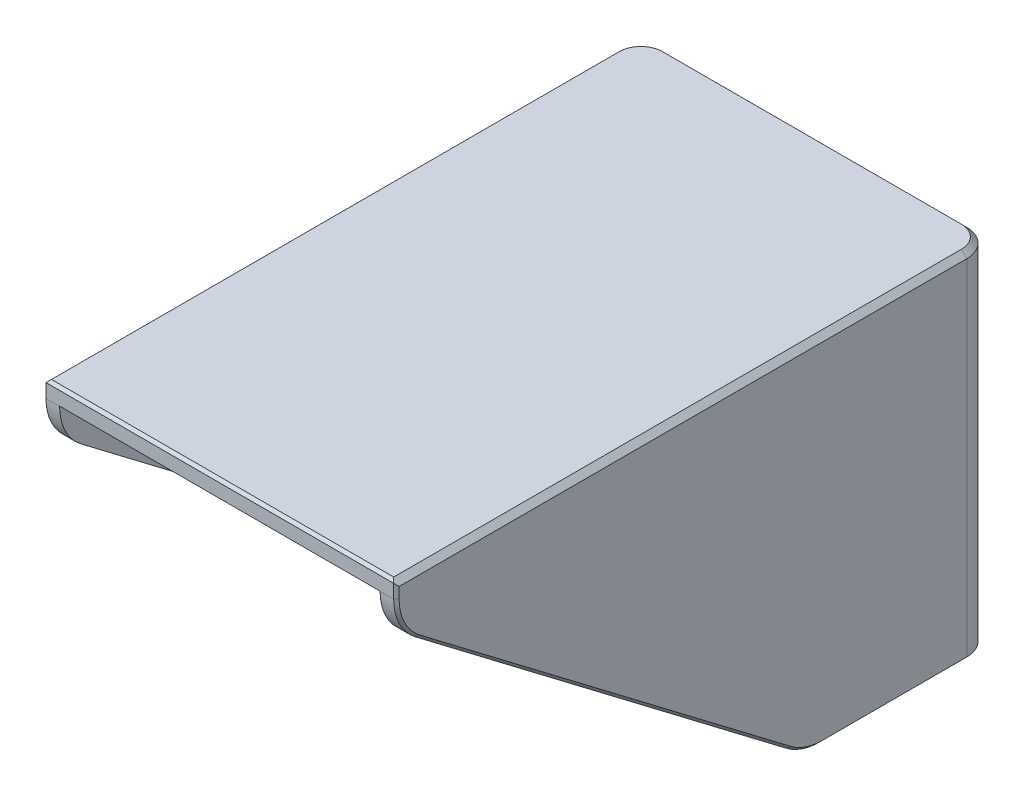
ISO-10303-21;
HEADER;
FILE_DESCRIPTION(('STEP AP214'),'2;1');
FILE_NAME('part.step','',(''),(''),'','','');
FILE_SCHEMA(('AUTOMOTIVE_DESIGN { 1 0 10303 214 1 1 1 1 }'));
ENDSEC;
DATA;
#1=APPLICATION_CONTEXT('core data for automotive mechanical design processes');
#2=APPLICATION_PROTOCOL_DEFINITION('international standard','automotive_design',2000,#1);
#3=PRODUCT_CONTEXT('',#1,'mechanical');
#4=PRODUCT('Part','Part','',(#3));
#5=PRODUCT_RELATED_PRODUCT_CATEGORY('part','',(#4));
#6=PRODUCT_DEFINITION_FORMATION('','',#4);
#7=PRODUCT_DEFINITION_CONTEXT('part definition',#1,'design');
#8=PRODUCT_DEFINITION('design','',#6,#7);
#9=PRODUCT_DEFINITION_SHAPE('','',#8);
#10=(LENGTH_UNIT() NAMED_UNIT(*) SI_UNIT(.MILLI.,.METRE.));
#11=(NAMED_UNIT(*) PLANE_ANGLE_UNIT() SI_UNIT($,.RADIAN.));
#12=(NAMED_UNIT(*) SI_UNIT($,.STERADIAN.) SOLID_ANGLE_UNIT());
#13=UNCERTAINTY_MEASURE_WITH_UNIT(LENGTH_MEASURE(1.E-05),#10,'distance_accuracy_value','');
#14=(GEOMETRIC_REPRESENTATION_CONTEXT(3) GLOBAL_UNCERTAINTY_ASSIGNED_CONTEXT((#13)) GLOBAL_UNIT_ASSIGNED_CONTEXT((#10,
#11,#12)) REPRESENTATION_CONTEXT('',''));
#15=CARTESIAN_POINT('',(0.,0.,0.));
#16=DIRECTION('',(0.,0.,1.));
#17=DIRECTION('',(1.,0.,0.));
#18=AXIS2_PLACEMENT_3D('',#15,#16,#17);
#19=CARTESIAN_POINT('',(0.,77.,0.));
#20=DIRECTION('',(0.,-1.,0.));
#21=DIRECTION('',(0.,0.,-1.));
#22=AXIS2_PLACEMENT_3D('',#19,#20,#21);
#23=PLANE('',#22);
#24=DIRECTION('',(-1.,0.,0.));
#25=VECTOR('',#24,1.);
#26=CARTESIAN_POINT('',(0.,77.,-59.5));
#27=LINE('',#26,#25);
#28=CARTESIAN_POINT('',(27.5,77.,-59.5));
#29=VERTEX_POINT('',#28);
#30=CARTESIAN_POINT('',(-27.5,77.,-59.5));
#31=VERTEX_POINT('',#30);
#32=EDGE_CURVE('E267',#29,#31,#27,.T.);
#33=ORIENTED_EDGE('',*,*,#32,.F.);
#34=CARTESIAN_POINT('',(27.5,77.,-57.5));
#35=DIRECTION('',(0.,-1.,0.));
#36=DIRECTION('',(0.,0.,-1.));
#37=AXIS2_PLACEMENT_3D('',#34,#35,#36);
#38=CIRCLE('',#37,2.);
#39=CARTESIAN_POINT('',(29.5,77.,-57.5));
#40=VERTEX_POINT('',#39);
#41=EDGE_CURVE('E265',#29,#40,#38,.T.);
#42=ORIENTED_EDGE('',*,*,#41,.T.);
#43=DIRECTION('',(0.,0.,-1.));
#44=VECTOR('',#43,1.);
#45=CARTESIAN_POINT('',(29.5,77.,0.));
#46=LINE('',#45,#44);
#47=CARTESIAN_POINT('',(29.5,77.,47.5));
#48=VERTEX_POINT('',#47);
#49=EDGE_CURVE('E240',#48,#40,#46,.T.);
#50=ORIENTED_EDGE('',*,*,#49,.F.);
#51=DIRECTION('',(-1.,0.,0.));
#52=VECTOR('',#51,1.);
#53=CARTESIAN_POINT('',(0.,77.,47.5));
#54=LINE('',#53,#52);
#55=CARTESIAN_POINT('',(-29.5,77.,47.5));
#56=VERTEX_POINT('',#55);
#57=EDGE_CURVE('E253',#48,#56,#54,.T.);
#58=ORIENTED_EDGE('',*,*,#57,.T.);
#59=DIRECTION('',(0.,0.,1.));
#60=VECTOR('',#59,1.);
#61=CARTESIAN_POINT('',(-29.5,77.,0.));
#62=LINE('',#61,#60);
#63=CARTESIAN_POINT('',(-29.5,77.,-57.5));
#64=VERTEX_POINT('',#63);
#65=EDGE_CURVE('E261',#64,#56,#62,.T.);
#66=ORIENTED_EDGE('',*,*,#65,.F.);
#67=CARTESIAN_POINT('',(-27.5,77.,-57.5));
#68=DIRECTION('',(0.,-1.,0.));
#69=DIRECTION('',(0.,0.,-1.));
#70=AXIS2_PLACEMENT_3D('',#67,#68,#69);
#71=CIRCLE('',#70,2.);
#72=EDGE_CURVE('E311',#64,#31,#71,.T.);
#73=ORIENTED_EDGE('',*,*,#72,.T.);
#74=EDGE_LOOP('',(#33,#42,#50,#58,#66,#73));
#75=FACE_BOUND('',#74,.T.);
#76=ADVANCED_FACE('F45',(#75),#23,.T.);
#77=CARTESIAN_POINT('',(-29.5,80.,62.5));
#78=DIRECTION('',(1.,0.,0.));
#79=DIRECTION('',(0.,0.,-1.));
#80=AXIS2_PLACEMENT_3D('',#77,#78,#79);
#81=PLANE('',#80);
#82=DIRECTION('',(0.,-1.,0.));
#83=VECTOR('',#82,1.);
#84=CARTESIAN_POINT('',(-29.5,80.,47.5));
#85=LINE('',#84,#83);
#86=CARTESIAN_POINT('',(-29.5,76.9602547744861,47.5));
#87=VERTEX_POINT('',#86);
#88=EDGE_CURVE('E249',#56,#87,#85,.T.);
#89=ORIENTED_EDGE('',*,*,#88,.T.);
#90=CARTESIAN_POINT('',(-29.5,76.9602547744861,37.5));
#91=DIRECTION('',(1.,0.,0.));
#92=DIRECTION('',(0.,0.,-1.));
#93=AXIS2_PLACEMENT_3D('',#90,#91,#92);
#94=CIRCLE('',#93,10.);
#95=CARTESIAN_POINT('',(-29.5,68.998632833255,43.5508326753356));
#96=VERTEX_POINT('',#95);
#97=EDGE_CURVE('E397',#87,#96,#94,.T.);
#98=ORIENTED_EDGE('',*,*,#97,.T.);
#99=DIRECTION('',(0.,-0.605083267533558,-0.796162194123103));
#100=VECTOR('',#99,1.);
#101=CARTESIAN_POINT('',(-29.5,82.1551724137931,60.8620689655172));
#102=LINE('',#101,#100);
#103=CARTESIAN_POINT('',(-29.5,17.038378058769,-24.817923606883));
#104=VERTEX_POINT('',#103);
#105=EDGE_CURVE('E260',#96,#104,#102,.T.);
#106=ORIENTED_EDGE('',*,*,#105,.T.);
#107=CARTESIAN_POINT('',(-29.5,25.,-30.8687562822185));
#108=DIRECTION('',(1.,0.,0.));
#109=DIRECTION('',(0.,0.,-1.));
#110=AXIS2_PLACEMENT_3D('',#107,#108,#109);
#111=CIRCLE('',#110,10.);
#112=CARTESIAN_POINT('',(-29.5,15.,-30.8687562822185));
#113=VERTEX_POINT('',#112);
#114=EDGE_CURVE('E394',#104,#113,#111,.T.);
#115=ORIENTED_EDGE('',*,*,#114,.T.);
#116=DIRECTION('',(0.,0.,-1.));
#117=VECTOR('',#116,1.);
#118=CARTESIAN_POINT('',(-29.5,15.,62.5));
#119=LINE('',#118,#117);
#120=CARTESIAN_POINT('',(-29.5,15.,-57.5));
#121=VERTEX_POINT('',#120);
#122=EDGE_CURVE('E284',#113,#121,#119,.T.);
#123=ORIENTED_EDGE('',*,*,#122,.T.);
#124=DIRECTION('',(0.,-1.,0.));
#125=VECTOR('',#124,1.);
#126=CARTESIAN_POINT('',(-29.5,77.,-57.5));
#127=LINE('',#126,#125);
#128=EDGE_CURVE('E316',#121,#64,#127,.F.);
#129=ORIENTED_EDGE('',*,*,#128,.T.);
#130=ORIENTED_EDGE('',*,*,#65,.T.);
#131=EDGE_LOOP('',(#89,#98,#106,#115,#123,#129,#130));
#132=FACE_BOUND('',#131,.T.);
#133=ADVANCED_FACE('F637',(#132),#81,.T.);
#134=CARTESIAN_POINT('',(-32.5,80.,-59.5));
#135=DIRECTION('',(0.,0.,1.));
#136=DIRECTION('',(1.,0.,0.));
#137=AXIS2_PLACEMENT_3D('',#134,#135,#136);
#138=PLANE('',#137);
#139=DIRECTION('',(1.,0.,0.));
#140=VECTOR('',#139,1.);
#141=CARTESIAN_POINT('',(-32.5,15.,-59.5));
#142=LINE('',#141,#140);
#143=CARTESIAN_POINT('',(-27.5,15.,-59.5));
#144=VERTEX_POINT('',#143);
#145=CARTESIAN_POINT('',(27.5,15.,-59.5));
#146=VERTEX_POINT('',#145);
#147=EDGE_CURVE('E275',#144,#146,#142,.T.);
#148=ORIENTED_EDGE('',*,*,#147,.T.);
#149=DIRECTION('',(0.,-1.,0.));
#150=VECTOR('',#149,1.);
#151=CARTESIAN_POINT('',(27.5,77.,-59.5));
#152=LINE('',#151,#150);
#153=EDGE_CURVE('E308',#146,#29,#152,.F.);
#154=ORIENTED_EDGE('',*,*,#153,.T.);
#155=ORIENTED_EDGE('',*,*,#32,.T.);
#156=DIRECTION('',(0.,-1.,0.));
#157=VECTOR('',#156,1.);
#158=CARTESIAN_POINT('',(-27.5,15.,-59.5));
#159=LINE('',#158,#157);
#160=EDGE_CURVE('E304',#31,#144,#159,.T.);
#161=ORIENTED_EDGE('',*,*,#160,.T.);
#162=EDGE_LOOP('',(#148,#154,#155,#161));
#163=FACE_BOUND('',#162,.T.);
#164=ADVANCED_FACE('F576',(#163),#138,.T.);
#165=CARTESIAN_POINT('',(29.5,80.,62.5));
#166=DIRECTION('',(-1.,0.,0.));
#167=DIRECTION('',(0.,0.,1.));
#168=AXIS2_PLACEMENT_3D('',#165,#166,#167);
#169=PLANE('',#168);
#170=DIRECTION('',(0.,0.605083267533558,0.796162194123103));
#171=VECTOR('',#170,1.);
#172=CARTESIAN_POINT('',(29.5,82.1551724137931,60.8620689655172));
#173=LINE('',#172,#171);
#174=CARTESIAN_POINT('',(29.5,17.038378058769,-24.817923606883));
#175=VERTEX_POINT('',#174);
#176=CARTESIAN_POINT('',(29.5,68.998632833255,43.5508326753356));
#177=VERTEX_POINT('',#176);
#178=EDGE_CURVE('E248',#175,#177,#173,.T.);
#179=ORIENTED_EDGE('',*,*,#178,.T.);
#180=CARTESIAN_POINT('',(29.5,76.9602547744861,37.5));
#181=DIRECTION('',(-1.,0.,0.));
#182=DIRECTION('',(0.,0.,1.));
#183=AXIS2_PLACEMENT_3D('',#180,#181,#182);
#184=CIRCLE('',#183,10.);
#185=CARTESIAN_POINT('',(29.5,76.9602547744861,47.5));
#186=VERTEX_POINT('',#185);
#187=EDGE_CURVE('E243',#177,#186,#184,.T.);
#188=ORIENTED_EDGE('',*,*,#187,.T.);
#189=DIRECTION('',(0.,1.,0.));
#190=VECTOR('',#189,1.);
#191=CARTESIAN_POINT('',(29.5,80.,47.5));
#192=LINE('',#191,#190);
#193=EDGE_CURVE('E234',#186,#48,#192,.T.);
#194=ORIENTED_EDGE('',*,*,#193,.T.);
#195=ORIENTED_EDGE('',*,*,#49,.T.);
#196=DIRECTION('',(0.,-1.,0.));
#197=VECTOR('',#196,1.);
#198=CARTESIAN_POINT('',(29.5,15.,-57.5));
#199=LINE('',#198,#197);
#200=CARTESIAN_POINT('',(29.5,15.,-57.5));
#201=VERTEX_POINT('',#200);
#202=EDGE_CURVE('E301',#40,#201,#199,.T.);
#203=ORIENTED_EDGE('',*,*,#202,.T.);
#204=DIRECTION('',(0.,0.,1.));
#205=VECTOR('',#204,1.);
#206=CARTESIAN_POINT('',(29.5,15.,62.5));
#207=LINE('',#206,#205);
#208=CARTESIAN_POINT('',(29.5,15.,-30.8687562822185));
#209=VERTEX_POINT('',#208);
#210=EDGE_CURVE('E268',#201,#209,#207,.T.);
#211=ORIENTED_EDGE('',*,*,#210,.T.);
#212=CARTESIAN_POINT('',(29.5,25.,-30.8687562822185));
#213=DIRECTION('',(-1.,0.,0.));
#214=DIRECTION('',(0.,0.,1.));
#215=AXIS2_PLACEMENT_3D('',#212,#213,#214);
#216=CIRCLE('',#215,10.);
#217=EDGE_CURVE('E389',#209,#175,#216,.T.);
#218=ORIENTED_EDGE('',*,*,#217,.T.);
#219=EDGE_LOOP('',(#179,#188,#194,#195,#203,#211,#218));
#220=FACE_BOUND('',#219,.T.);
#221=ADVANCED_FACE('F237',(#220),#169,.T.);
#222=CARTESIAN_POINT('',(-32.5,72.,47.5));
#223=DIRECTION('',(0.,-0.796162194123103,0.605083267533558));
#224=DIRECTION('',(0.,-0.605083267533558,-0.796162194123103));
#225=AXIS2_PLACEMENT_3D('',#222,#223,#224);
#226=PLANE('',#225);
#227=DIRECTION('',(1.,0.,0.));
#228=VECTOR('',#227,1.);
#229=CARTESIAN_POINT('',(-32.5,17.038378058769,-24.8179236068829));
#230=LINE('',#229,#228);
#231=CARTESIAN_POINT('',(32.,17.038378058769,-24.8179236068829));
#232=VERTEX_POINT('',#231);
#233=EDGE_CURVE('E383',#175,#232,#230,.T.);
#234=ORIENTED_EDGE('',*,*,#233,.T.);
#235=DIRECTION('',(0.,0.605083267533558,0.796162194123103));
#236=VECTOR('',#235,1.);
#237=CARTESIAN_POINT('',(32.,68.998632833255,43.5508326753356));
#238=LINE('',#237,#236);
#239=CARTESIAN_POINT('',(32.,68.998632833255,43.5508326753356));
#240=VERTEX_POINT('',#239);
#241=EDGE_CURVE('E56',#232,#240,#238,.T.);
#242=ORIENTED_EDGE('',*,*,#241,.T.);
#243=DIRECTION('',(1.,0.,0.));
#244=VECTOR('',#243,1.);
#245=CARTESIAN_POINT('',(-32.5,68.998632833255,43.5508326753356));
#246=LINE('',#245,#244);
#247=EDGE_CURVE('E386',#240,#177,#246,.F.);
#248=ORIENTED_EDGE('',*,*,#247,.T.);
#249=ORIENTED_EDGE('',*,*,#178,.F.);
#250=EDGE_LOOP('',(#234,#242,#248,#249));
#251=FACE_BOUND('',#250,.T.);
#252=ADVANCED_FACE('F974',(#251),#226,.T.);
#253=CARTESIAN_POINT('',(-32.5,15.,-27.5));
#254=DIRECTION('',(0.,-1.,0.));
#255=DIRECTION('',(0.,0.,-1.));
#256=AXIS2_PLACEMENT_3D('',#253,#254,#255);
#257=PLANE('',#256);
#258=DIRECTION('',(1.,0.,0.));
#259=VECTOR('',#258,1.);
#260=CARTESIAN_POINT('',(-32.5,15.,-30.8687562822185));
#261=LINE('',#260,#259);
#262=CARTESIAN_POINT('',(-32.,15.,-30.8687562822185));
#263=VERTEX_POINT('',#262);
#264=EDGE_CURVE('E407',#113,#263,#261,.F.);
#265=ORIENTED_EDGE('',*,*,#264,.T.);
#266=DIRECTION('',(0.,0.,-1.));
#267=VECTOR('',#266,1.);
#268=CARTESIAN_POINT('',(-32.,15.,-57.5));
#269=LINE('',#268,#267);
#270=CARTESIAN_POINT('',(-32.,15.,-57.5));
#271=VERTEX_POINT('',#270);
#272=EDGE_CURVE('E477',#263,#271,#269,.T.);
#273=ORIENTED_EDGE('',*,*,#272,.T.);
#274=CARTESIAN_POINT('',(-27.5,15.,-57.5));
#275=DIRECTION('',(0.,-1.,0.));
#276=DIRECTION('',(0.,0.,-1.));
#277=AXIS2_PLACEMENT_3D('',#274,#275,#276);
#278=CIRCLE('',#277,4.5);
#279=CARTESIAN_POINT('',(-27.5,15.,-62.));
#280=VERTEX_POINT('',#279);
#281=EDGE_CURVE('E474',#271,#280,#278,.T.);
#282=ORIENTED_EDGE('',*,*,#281,.T.);
#283=DIRECTION('',(1.,0.,0.));
#284=VECTOR('',#283,1.);
#285=CARTESIAN_POINT('',(27.5,15.,-62.));
#286=LINE('',#285,#284);
#287=CARTESIAN_POINT('',(27.5,15.,-62.));
#288=VERTEX_POINT('',#287);
#289=EDGE_CURVE('E471',#280,#288,#286,.T.);
#290=ORIENTED_EDGE('',*,*,#289,.T.);
#291=CARTESIAN_POINT('',(27.5,15.,-57.5));
#292=DIRECTION('',(0.,-1.,0.));
#293=DIRECTION('',(0.,0.,-1.));
#294=AXIS2_PLACEMENT_3D('',#291,#292,#293);
#295=CIRCLE('',#294,4.5);
#296=CARTESIAN_POINT('',(32.,15.,-57.5));
#297=VERTEX_POINT('',#296);
#298=EDGE_CURVE('E468',#288,#297,#295,.T.);
#299=ORIENTED_EDGE('',*,*,#298,.T.);
#300=DIRECTION('',(0.,0.,1.));
#301=VECTOR('',#300,1.);
#302=CARTESIAN_POINT('',(32.,15.,-30.8687562822185));
#303=LINE('',#302,#301);
#304=CARTESIAN_POINT('',(32.,15.,-30.8687562822185));
#305=VERTEX_POINT('',#304);
#306=EDGE_CURVE('E465',#297,#305,#303,.T.);
#307=ORIENTED_EDGE('',*,*,#306,.T.);
#308=DIRECTION('',(1.,0.,0.));
#309=VECTOR('',#308,1.);
#310=CARTESIAN_POINT('',(-32.5,15.,-30.8687562822185));
#311=LINE('',#310,#309);
#312=EDGE_CURVE('E411',#305,#209,#311,.F.);
#313=ORIENTED_EDGE('',*,*,#312,.T.);
#314=ORIENTED_EDGE('',*,*,#210,.F.);
#315=CARTESIAN_POINT('',(27.5,15.,-57.5));
#316=DIRECTION('',(0.,-1.,0.));
#317=DIRECTION('',(0.,0.,-1.));
#318=AXIS2_PLACEMENT_3D('',#315,#316,#317);
#319=CIRCLE('',#318,2.);
#320=EDGE_CURVE('E319',#201,#146,#319,.F.);
#321=ORIENTED_EDGE('',*,*,#320,.T.);
#322=ORIENTED_EDGE('',*,*,#147,.F.);
#323=CARTESIAN_POINT('',(-27.5,15.,-57.5));
#324=DIRECTION('',(0.,-1.,0.));
#325=DIRECTION('',(0.,0.,-1.));
#326=AXIS2_PLACEMENT_3D('',#323,#324,#325);
#327=CIRCLE('',#326,2.);
#328=EDGE_CURVE('E322',#144,#121,#327,.F.);
#329=ORIENTED_EDGE('',*,*,#328,.T.);
#330=ORIENTED_EDGE('',*,*,#122,.F.);
#331=EDGE_LOOP('',(#265,#273,#282,#290,#299,#307,#313,#314,#321,#322,#329,#330));
#332=FACE_BOUND('',#331,.T.);
#333=ADVANCED_FACE('F583',(#332),#257,.T.);
#334=DIRECTION('',(1.,0.,0.));
#335=VECTOR('',#334,1.);
#336=CARTESIAN_POINT('',(-32.5,68.998632833255,43.5508326753356));
#337=LINE('',#336,#335);
#338=CARTESIAN_POINT('',(-32.,68.998632833255,43.5508326753356));
#339=VERTEX_POINT('',#338);
#340=EDGE_CURVE('E403',#96,#339,#337,.F.);
#341=ORIENTED_EDGE('',*,*,#340,.T.);
#342=DIRECTION('',(0.,-0.605083267533558,-0.796162194123103));
#343=VECTOR('',#342,1.);
#344=CARTESIAN_POINT('',(-32.,17.038378058769,-24.8179236068829));
#345=LINE('',#344,#343);
#346=CARTESIAN_POINT('',(-32.,17.038378058769,-24.8179236068829));
#347=VERTEX_POINT('',#346);
#348=EDGE_CURVE('E459',#339,#347,#345,.T.);
#349=ORIENTED_EDGE('',*,*,#348,.T.);
#350=DIRECTION('',(1.,0.,0.));
#351=VECTOR('',#350,1.);
#352=CARTESIAN_POINT('',(-32.5,17.038378058769,-24.8179236068829));
#353=LINE('',#352,#351);
#354=EDGE_CURVE('E400',#347,#104,#353,.T.);
#355=ORIENTED_EDGE('',*,*,#354,.T.);
#356=ORIENTED_EDGE('',*,*,#105,.F.);
#357=EDGE_LOOP('',(#341,#349,#355,#356));
#358=FACE_BOUND('',#357,.T.);
#359=ADVANCED_FACE('F963',(#358),#226,.T.);
#360=CARTESIAN_POINT('',(-32.5,80.,47.5));
#361=DIRECTION('',(0.,0.,1.));
#362=DIRECTION('',(0.,-1.,0.));
#363=AXIS2_PLACEMENT_3D('',#360,#361,#362);
#364=PLANE('',#363);
#365=DIRECTION('',(-1.,0.,0.));
#366=VECTOR('',#365,1.);
#367=CARTESIAN_POINT('',(-31.5,79.5,47.5));
#368=LINE('',#367,#366);
#369=CARTESIAN_POINT('',(32.,79.5,47.5));
#370=VERTEX_POINT('',#369);
#371=CARTESIAN_POINT('',(-32.,79.5,47.5));
#372=VERTEX_POINT('',#371);
#373=EDGE_CURVE('E428',#370,#372,#368,.T.);
#374=ORIENTED_EDGE('',*,*,#373,.T.);
#375=DIRECTION('',(0.,-1.,0.));
#376=VECTOR('',#375,1.);
#377=CARTESIAN_POINT('',(-32.,76.9602547744861,47.5));
#378=LINE('',#377,#376);
#379=CARTESIAN_POINT('',(-32.,76.9602547744861,47.5));
#380=VERTEX_POINT('',#379);
#381=EDGE_CURVE('E431',#372,#380,#378,.T.);
#382=ORIENTED_EDGE('',*,*,#381,.T.);
#383=DIRECTION('',(1.,0.,0.));
#384=VECTOR('',#383,1.);
#385=CARTESIAN_POINT('',(-32.5,76.9602547744861,47.5));
#386=LINE('',#385,#384);
#387=EDGE_CURVE('E360',#380,#87,#386,.T.);
#388=ORIENTED_EDGE('',*,*,#387,.T.);
#389=ORIENTED_EDGE('',*,*,#88,.F.);
#390=ORIENTED_EDGE('',*,*,#57,.F.);
#391=ORIENTED_EDGE('',*,*,#193,.F.);
#392=DIRECTION('',(1.,0.,0.));
#393=VECTOR('',#392,1.);
#394=CARTESIAN_POINT('',(-32.5,76.9602547744861,47.5));
#395=LINE('',#394,#393);
#396=CARTESIAN_POINT('',(32.,76.9602547744861,47.5));
#397=VERTEX_POINT('',#396);
#398=EDGE_CURVE('E380',#186,#397,#395,.T.);
#399=ORIENTED_EDGE('',*,*,#398,.T.);
#400=DIRECTION('',(0.,1.,0.));
#401=VECTOR('',#400,1.);
#402=CARTESIAN_POINT('',(32.,79.,47.5));
#403=LINE('',#402,#401);
#404=EDGE_CURVE('E425',#397,#370,#403,.T.);
#405=ORIENTED_EDGE('',*,*,#404,.T.);
#406=EDGE_LOOP('',(#374,#382,#388,#389,#390,#391,#399,#405));
#407=FACE_BOUND('',#406,.T.);
#408=ADVANCED_FACE('F255',(#407),#364,.T.);
#409=CARTESIAN_POINT('',(32.5,80.,62.5));
#410=DIRECTION('',(-1.,0.,0.));
#411=DIRECTION('',(0.,0.,1.));
#412=AXIS2_PLACEMENT_3D('',#409,#410,#411);
#413=PLANE('',#412);
#414=CARTESIAN_POINT('',(32.5,25.,-30.8687562822185));
#415=DIRECTION('',(-1.,0.,0.));
#416=DIRECTION('',(0.,0.,1.));
#417=AXIS2_PLACEMENT_3D('',#414,#415,#416);
#418=CIRCLE('',#417,9.49999999999999);
#419=CARTESIAN_POINT('',(32.5,17.4364591558305,-25.1204652406497));
#420=VERTEX_POINT('',#419);
#421=CARTESIAN_POINT('',(32.5,15.5,-30.8687562822185));
#422=VERTEX_POINT('',#421);
#423=EDGE_CURVE('E498',#420,#422,#418,.F.);
#424=ORIENTED_EDGE('',*,*,#423,.T.);
#425=DIRECTION('',(0.,0.,-1.));
#426=VECTOR('',#425,1.);
#427=CARTESIAN_POINT('',(32.5,15.5,-57.5));
#428=LINE('',#427,#426);
#429=CARTESIAN_POINT('',(32.5,15.5,-57.5));
#430=VERTEX_POINT('',#429);
#431=EDGE_CURVE('E501',#422,#430,#428,.T.);
#432=ORIENTED_EDGE('',*,*,#431,.T.);
#433=DIRECTION('',(0.,-1.,0.));
#434=VECTOR('',#433,1.);
#435=CARTESIAN_POINT('',(32.5,80.,-57.5));
#436=LINE('',#435,#434);
#437=CARTESIAN_POINT('',(32.5,79.,-57.5));
#438=VERTEX_POINT('',#437);
#439=EDGE_CURVE('E298',#430,#438,#436,.F.);
#440=ORIENTED_EDGE('',*,*,#439,.T.);
#441=DIRECTION('',(0.,0.,1.));
#442=VECTOR('',#441,1.);
#443=CARTESIAN_POINT('',(32.5,79.,62.5));
#444=LINE('',#443,#442);
#445=CARTESIAN_POINT('',(32.5,79.,47.));
#446=VERTEX_POINT('',#445);
#447=EDGE_CURVE('E349',#438,#446,#444,.T.);
#448=ORIENTED_EDGE('',*,*,#447,.T.);
#449=DIRECTION('',(0.,-1.,0.));
#450=VECTOR('',#449,1.);
#451=CARTESIAN_POINT('',(32.5,76.9602547744861,47.));
#452=LINE('',#451,#450);
#453=CARTESIAN_POINT('',(32.5,76.9602547744861,47.));
#454=VERTEX_POINT('',#453);
#455=EDGE_CURVE('E495',#446,#454,#452,.T.);
#456=ORIENTED_EDGE('',*,*,#455,.T.);
#457=CARTESIAN_POINT('',(32.5,76.9602547744861,37.5));
#458=DIRECTION('',(-1.,0.,0.));
#459=DIRECTION('',(0.,0.,1.));
#460=AXIS2_PLACEMENT_3D('',#457,#458,#459);
#461=CIRCLE('',#460,9.49999999999999);
#462=CARTESIAN_POINT('',(32.5,69.3967139303166,43.2482910415688));
#463=VERTEX_POINT('',#462);
#464=EDGE_CURVE('E489',#454,#463,#461,.F.);
#465=ORIENTED_EDGE('',*,*,#464,.T.);
#466=DIRECTION('',(0.,-0.605083267533558,-0.796162194123103));
#467=VECTOR('',#466,1.);
#468=CARTESIAN_POINT('',(32.5,17.4364591558305,-25.1204652406497));
#469=LINE('',#468,#467);
#470=EDGE_CURVE('E492',#463,#420,#469,.T.);
#471=ORIENTED_EDGE('',*,*,#470,.T.);
#472=EDGE_LOOP('',(#424,#432,#440,#448,#456,#465,#471));
#473=FACE_BOUND('',#472,.T.);
#474=ADVANCED_FACE('F598',(#473),#413,.F.);
#475=CARTESIAN_POINT('',(-32.5,80.,-62.5));
#476=DIRECTION('',(0.,0.,1.));
#477=DIRECTION('',(1.,0.,0.));
#478=AXIS2_PLACEMENT_3D('',#475,#476,#477);
#479=PLANE('',#478);
#480=CARTESIAN_POINT('',(0.,55.,-62.5));
#481=DIRECTION('',(0.,0.,-1.));
#482=DIRECTION('',(-1.,0.,0.));
#483=AXIS2_PLACEMENT_3D('',#480,#481,#482);
#484=CIRCLE('',#483,15.24);
#485=CARTESIAN_POINT('',(-15.24,55.,-62.5));
#486=VERTEX_POINT('',#485);
#487=EDGE_CURVE('E554',#486,#486,#484,.T.);
#488=ORIENTED_EDGE('',*,*,#487,.F.);
#489=EDGE_LOOP('',(#488));
#490=FACE_BOUND('',#489,.T.);
#491=DIRECTION('',(0.,-1.,0.));
#492=VECTOR('',#491,1.);
#493=CARTESIAN_POINT('',(27.5,80.,-62.5));
#494=LINE('',#493,#492);
#495=CARTESIAN_POINT('',(27.5,79.,-62.5));
#496=VERTEX_POINT('',#495);
#497=CARTESIAN_POINT('',(27.5,15.5,-62.5));
#498=VERTEX_POINT('',#497);
#499=EDGE_CURVE('E291',#496,#498,#494,.T.);
#500=ORIENTED_EDGE('',*,*,#499,.T.);
#501=DIRECTION('',(-1.,0.,0.));
#502=VECTOR('',#501,1.);
#503=CARTESIAN_POINT('',(-27.5,15.5,-62.5));
#504=LINE('',#503,#502);
#505=CARTESIAN_POINT('',(-27.5,15.5,-62.5));
#506=VERTEX_POINT('',#505);
#507=EDGE_CURVE('E483',#498,#506,#504,.T.);
#508=ORIENTED_EDGE('',*,*,#507,.T.);
#509=DIRECTION('',(0.,-1.,0.));
#510=VECTOR('',#509,1.);
#511=CARTESIAN_POINT('',(-27.5,80.,-62.5));
#512=LINE('',#511,#510);
#513=CARTESIAN_POINT('',(-27.5,79.,-62.5));
#514=VERTEX_POINT('',#513);
#515=EDGE_CURVE('E295',#506,#514,#512,.F.);
#516=ORIENTED_EDGE('',*,*,#515,.T.);
#517=DIRECTION('',(1.,0.,0.));
#518=VECTOR('',#517,1.);
#519=CARTESIAN_POINT('',(-32.5,79.,-62.5));
#520=LINE('',#519,#518);
#521=EDGE_CURVE('E353',#514,#496,#520,.T.);
#522=ORIENTED_EDGE('',*,*,#521,.T.);
#523=EDGE_LOOP('',(#500,#508,#516,#522));
#524=FACE_BOUND('',#523,.T.);
#525=ADVANCED_FACE('F653',(#490,#524),#479,.F.);
#526=CARTESIAN_POINT('',(-32.5,80.,62.5));
#527=DIRECTION('',(1.,0.,0.));
#528=DIRECTION('',(0.,0.,-1.));
#529=AXIS2_PLACEMENT_3D('',#526,#527,#528);
#530=PLANE('',#529);
#531=CARTESIAN_POINT('',(-32.5,76.9602547744861,37.5));
#532=DIRECTION('',(1.,0.,0.));
#533=DIRECTION('',(0.,0.,-1.));
#534=AXIS2_PLACEMENT_3D('',#531,#532,#533);
#535=CIRCLE('',#534,9.49999999999999);
#536=CARTESIAN_POINT('',(-32.5,69.3967139303166,43.2482910415688));
#537=VERTEX_POINT('',#536);
#538=CARTESIAN_POINT('',(-32.5,76.9602547744861,47.));
#539=VERTEX_POINT('',#538);
#540=EDGE_CURVE('E450',#537,#539,#535,.F.);
#541=ORIENTED_EDGE('',*,*,#540,.T.);
#542=DIRECTION('',(0.,1.,0.));
#543=VECTOR('',#542,1.);
#544=CARTESIAN_POINT('',(-32.5,79.,47.));
#545=LINE('',#544,#543);
#546=CARTESIAN_POINT('',(-32.5,79.,47.));
#547=VERTEX_POINT('',#546);
#548=EDGE_CURVE('E453',#539,#547,#545,.T.);
#549=ORIENTED_EDGE('',*,*,#548,.T.);
#550=DIRECTION('',(0.,0.,-1.));
#551=VECTOR('',#550,1.);
#552=CARTESIAN_POINT('',(-32.5,79.,62.5));
#553=LINE('',#552,#551);
#554=CARTESIAN_POINT('',(-32.5,79.,-57.5));
#555=VERTEX_POINT('',#554);
#556=EDGE_CURVE('E342',#547,#555,#553,.T.);
#557=ORIENTED_EDGE('',*,*,#556,.T.);
#558=DIRECTION('',(0.,-1.,0.));
#559=VECTOR('',#558,1.);
#560=CARTESIAN_POINT('',(-32.5,80.,-57.5));
#561=LINE('',#560,#559);
#562=CARTESIAN_POINT('',(-32.5,15.5,-57.5));
#563=VERTEX_POINT('',#562);
#564=EDGE_CURVE('E287',#555,#563,#561,.T.);
#565=ORIENTED_EDGE('',*,*,#564,.T.);
#566=DIRECTION('',(0.,0.,1.));
#567=VECTOR('',#566,1.);
#568=CARTESIAN_POINT('',(-32.5,15.5,-30.8687562822185));
#569=LINE('',#568,#567);
#570=CARTESIAN_POINT('',(-32.5,15.5,-30.8687562822185));
#571=VERTEX_POINT('',#570);
#572=EDGE_CURVE('E441',#563,#571,#569,.T.);
#573=ORIENTED_EDGE('',*,*,#572,.T.);
#574=CARTESIAN_POINT('',(-32.5,25.,-30.8687562822185));
#575=DIRECTION('',(1.,0.,0.));
#576=DIRECTION('',(0.,0.,-1.));
#577=AXIS2_PLACEMENT_3D('',#574,#575,#576);
#578=CIRCLE('',#577,9.5);
#579=CARTESIAN_POINT('',(-32.5,17.4364591558305,-25.1204652406497));
#580=VERTEX_POINT('',#579);
#581=EDGE_CURVE('E444',#571,#580,#578,.F.);
#582=ORIENTED_EDGE('',*,*,#581,.T.);
#583=DIRECTION('',(0.,0.605083267533558,0.796162194123103));
#584=VECTOR('',#583,1.);
#585=CARTESIAN_POINT('',(-32.5,69.3967139303166,43.2482910415688));
#586=LINE('',#585,#584);
#587=EDGE_CURVE('E447',#580,#537,#586,.T.);
#588=ORIENTED_EDGE('',*,*,#587,.T.);
#589=EDGE_LOOP('',(#541,#549,#557,#565,#573,#582,#588));
#590=FACE_BOUND('',#589,.T.);
#591=ADVANCED_FACE('F650',(#590),#530,.F.);
#592=CARTESIAN_POINT('',(0.,80.,0.));
#593=DIRECTION('',(0.,-1.,0.));
#594=DIRECTION('',(0.,0.,-1.));
#595=AXIS2_PLACEMENT_3D('',#592,#593,#594);
#596=PLANE('',#595);
#597=DIRECTION('',(0.,0.,1.));
#598=VECTOR('',#597,1.);
#599=CARTESIAN_POINT('',(-31.5,80.,0.));
#600=LINE('',#599,#598);
#601=CARTESIAN_POINT('',(-31.5,80.,-57.5));
#602=VERTEX_POINT('',#601);
#603=CARTESIAN_POINT('',(-31.5,80.,47.));
#604=VERTEX_POINT('',#603);
#605=EDGE_CURVE('E338',#602,#604,#600,.T.);
#606=ORIENTED_EDGE('',*,*,#605,.T.);
#607=DIRECTION('',(1.,0.,0.));
#608=VECTOR('',#607,1.);
#609=CARTESIAN_POINT('',(31.5,80.,47.));
#610=LINE('',#609,#608);
#611=CARTESIAN_POINT('',(31.5,80.,47.));
#612=VERTEX_POINT('',#611);
#613=EDGE_CURVE('E414',#604,#612,#610,.T.);
#614=ORIENTED_EDGE('',*,*,#613,.T.);
#615=DIRECTION('',(0.,0.,-1.));
#616=VECTOR('',#615,1.);
#617=CARTESIAN_POINT('',(31.5,80.,0.));
#618=LINE('',#617,#616);
#619=CARTESIAN_POINT('',(31.5,80.,-57.5));
#620=VERTEX_POINT('',#619);
#621=EDGE_CURVE('E332',#612,#620,#618,.T.);
#622=ORIENTED_EDGE('',*,*,#621,.T.);
#623=CARTESIAN_POINT('',(27.5,80.,-57.5));
#624=DIRECTION('',(0.,-1.,0.));
#625=DIRECTION('',(0.,0.,-1.));
#626=AXIS2_PLACEMENT_3D('',#623,#624,#625);
#627=CIRCLE('',#626,4.);
#628=CARTESIAN_POINT('',(27.5,80.,-61.5));
#629=VERTEX_POINT('',#628);
#630=EDGE_CURVE('E326',#620,#629,#627,.F.);
#631=ORIENTED_EDGE('',*,*,#630,.T.);
#632=DIRECTION('',(-1.,0.,0.));
#633=VECTOR('',#632,1.);
#634=CARTESIAN_POINT('',(0.,80.,-61.5));
#635=LINE('',#634,#633);
#636=CARTESIAN_POINT('',(-27.5,80.,-61.5));
#637=VERTEX_POINT('',#636);
#638=EDGE_CURVE('E329',#629,#637,#635,.T.);
#639=ORIENTED_EDGE('',*,*,#638,.T.);
#640=CARTESIAN_POINT('',(-27.5,80.,-57.5));
#641=DIRECTION('',(0.,-1.,0.));
#642=DIRECTION('',(0.,0.,-1.));
#643=AXIS2_PLACEMENT_3D('',#640,#641,#642);
#644=CIRCLE('',#643,4.00000000000001);
#645=EDGE_CURVE('E335',#637,#602,#644,.F.);
#646=ORIENTED_EDGE('',*,*,#645,.T.);
#647=EDGE_LOOP('',(#606,#614,#622,#631,#639,#646));
#648=FACE_BOUND('',#647,.T.);
#649=ADVANCED_FACE('F616',(#648),#596,.F.);
#650=CARTESIAN_POINT('',(-27.5,80.,-57.5));
#651=DIRECTION('',(0.,-1.,0.));
#652=DIRECTION('',(0.,0.,-1.));
#653=AXIS2_PLACEMENT_3D('',#650,#651,#652);
#654=CYLINDRICAL_SURFACE('',#653,5.);
#655=ORIENTED_EDGE('',*,*,#515,.F.);
#656=CARTESIAN_POINT('',(-27.5,15.5,-57.5));
#657=DIRECTION('',(0.,-1.,0.));
#658=DIRECTION('',(0.,0.,-1.));
#659=AXIS2_PLACEMENT_3D('',#656,#657,#658);
#660=CIRCLE('',#659,5.);
#661=EDGE_CURVE('E480',#506,#563,#660,.F.);
#662=ORIENTED_EDGE('',*,*,#661,.T.);
#663=ORIENTED_EDGE('',*,*,#564,.F.);
#664=CARTESIAN_POINT('',(-27.5,79.,-57.5));
#665=DIRECTION('',(0.,-1.,0.));
#666=DIRECTION('',(0.,0.,-1.));
#667=AXIS2_PLACEMENT_3D('',#664,#665,#666);
#668=CIRCLE('',#667,5.);
#669=EDGE_CURVE('E345',#555,#514,#668,.T.);
#670=ORIENTED_EDGE('',*,*,#669,.T.);
#671=EDGE_LOOP('',(#655,#662,#663,#670));
#672=FACE_BOUND('',#671,.T.);
#673=ADVANCED_FACE('F649',(#672),#654,.T.);
#674=CARTESIAN_POINT('',(27.5,80.,-57.5));
#675=DIRECTION('',(0.,-1.,0.));
#676=DIRECTION('',(0.,0.,-1.));
#677=AXIS2_PLACEMENT_3D('',#674,#675,#676);
#678=CYLINDRICAL_SURFACE('',#677,5.);
#679=ORIENTED_EDGE('',*,*,#439,.F.);
#680=CARTESIAN_POINT('',(27.5,15.5,-57.5));
#681=DIRECTION('',(0.,-1.,0.));
#682=DIRECTION('',(0.,0.,-1.));
#683=AXIS2_PLACEMENT_3D('',#680,#681,#682);
#684=CIRCLE('',#683,5.);
#685=EDGE_CURVE('E486',#430,#498,#684,.F.);
#686=ORIENTED_EDGE('',*,*,#685,.T.);
#687=ORIENTED_EDGE('',*,*,#499,.F.);
#688=CARTESIAN_POINT('',(27.5,79.,-57.5));
#689=DIRECTION('',(0.,-1.,0.));
#690=DIRECTION('',(0.,0.,-1.));
#691=AXIS2_PLACEMENT_3D('',#688,#689,#690);
#692=CIRCLE('',#691,5.);
#693=EDGE_CURVE('E356',#496,#438,#692,.T.);
#694=ORIENTED_EDGE('',*,*,#693,.T.);
#695=EDGE_LOOP('',(#679,#686,#687,#694));
#696=FACE_BOUND('',#695,.T.);
#697=ADVANCED_FACE('F600',(#696),#678,.T.);
#698=CARTESIAN_POINT('',(27.5,80.,-57.5));
#699=DIRECTION('',(0.,1.,0.));
#700=DIRECTION('',(0.,0.,1.));
#701=AXIS2_PLACEMENT_3D('',#698,#699,#700);
#702=CYLINDRICAL_SURFACE('',#701,2.);
#703=ORIENTED_EDGE('',*,*,#41,.F.);
#704=ORIENTED_EDGE('',*,*,#153,.F.);
#705=ORIENTED_EDGE('',*,*,#320,.F.);
#706=ORIENTED_EDGE('',*,*,#202,.F.);
#707=EDGE_LOOP('',(#703,#704,#705,#706));
#708=FACE_BOUND('',#707,.T.);
#709=ADVANCED_FACE('F580',(#708),#702,.F.);
#710=CARTESIAN_POINT('',(-27.5,80.,-57.5));
#711=DIRECTION('',(0.,1.,0.));
#712=DIRECTION('',(0.,0.,1.));
#713=AXIS2_PLACEMENT_3D('',#710,#711,#712);
#714=CYLINDRICAL_SURFACE('',#713,2.);
#715=ORIENTED_EDGE('',*,*,#72,.F.);
#716=ORIENTED_EDGE('',*,*,#128,.F.);
#717=ORIENTED_EDGE('',*,*,#328,.F.);
#718=ORIENTED_EDGE('',*,*,#160,.F.);
#719=EDGE_LOOP('',(#715,#716,#717,#718));
#720=FACE_BOUND('',#719,.T.);
#721=ADVANCED_FACE('F667',(#720),#714,.F.);
#722=CARTESIAN_POINT('',(31.5,80.,0.));
#723=DIRECTION('',(-0.707106781186545,-0.70710678118655,0.));
#724=DIRECTION('',(0.,0.,-1.));
#725=AXIS2_PLACEMENT_3D('',#722,#723,#724);
#726=PLANE('',#725);
#727=ORIENTED_EDGE('',*,*,#621,.F.);
#728=DIRECTION('',(-0.577350269189628,0.577350269189624,-0.577350269189624));
#729=VECTOR('',#728,1.);
#730=CARTESIAN_POINT('',(15.8333333333333,95.6666666666666,31.3333333333334));
#731=LINE('',#730,#729);
#732=EDGE_CURVE('E421',#612,#370,#731,.F.);
#733=ORIENTED_EDGE('',*,*,#732,.T.);
#734=DIRECTION('',(-0.577350269189625,0.57735026918962,0.577350269189632));
#735=VECTOR('',#734,1.);
#736=CARTESIAN_POINT('',(47.5000000000002,64.,31.9999999999996));
#737=LINE('',#736,#735);
#738=EDGE_CURVE('E418',#370,#446,#737,.F.);
#739=ORIENTED_EDGE('',*,*,#738,.T.);
#740=ORIENTED_EDGE('',*,*,#447,.F.);
#741=DIRECTION('',(0.70710678118655,-0.707106781186545,0.));
#742=VECTOR('',#741,1.);
#743=CARTESIAN_POINT('',(31.5,80.,-57.5));
#744=LINE('',#743,#742);
#745=EDGE_CURVE('E374',#620,#438,#744,.T.);
#746=ORIENTED_EDGE('',*,*,#745,.F.);
#747=EDGE_LOOP('',(#727,#733,#739,#740,#746));
#748=FACE_BOUND('',#747,.T.);
#749=ADVANCED_FACE('F609',(#748),#726,.F.);
#750=CARTESIAN_POINT('',(27.5,80.,-57.5));
#751=DIRECTION('',(0.,-1.,0.));
#752=DIRECTION('',(0.,0.,-1.));
#753=AXIS2_PLACEMENT_3D('',#750,#751,#752);
#754=CONICAL_SURFACE('',#753,4.,0.785398163397453);
#755=ORIENTED_EDGE('',*,*,#745,.T.);
#756=ORIENTED_EDGE('',*,*,#693,.F.);
#757=DIRECTION('',(0.,-0.707106781186545,-0.70710678118655));
#758=VECTOR('',#757,1.);
#759=CARTESIAN_POINT('',(27.5,80.,-61.5));
#760=LINE('',#759,#758);
#761=EDGE_CURVE('E370',#629,#496,#760,.T.);
#762=ORIENTED_EDGE('',*,*,#761,.F.);
#763=ORIENTED_EDGE('',*,*,#630,.F.);
#764=EDGE_LOOP('',(#755,#756,#762,#763));
#765=FACE_BOUND('',#764,.T.);
#766=ADVANCED_FACE('F613',(#765),#754,.T.);
#767=CARTESIAN_POINT('',(0.,80.,-61.5));
#768=DIRECTION('',(0.,-0.70710678118655,0.707106781186545));
#769=DIRECTION('',(-1.,0.,0.));
#770=AXIS2_PLACEMENT_3D('',#767,#768,#769);
#771=PLANE('',#770);
#772=ORIENTED_EDGE('',*,*,#761,.T.);
#773=ORIENTED_EDGE('',*,*,#521,.F.);
#774=DIRECTION('',(0.,-0.707106781186545,-0.70710678118655));
#775=VECTOR('',#774,1.);
#776=CARTESIAN_POINT('',(-27.5,80.,-61.5));
#777=LINE('',#776,#775);
#778=EDGE_CURVE('E365',#637,#514,#777,.T.);
#779=ORIENTED_EDGE('',*,*,#778,.F.);
#780=ORIENTED_EDGE('',*,*,#638,.F.);
#781=EDGE_LOOP('',(#772,#773,#779,#780));
#782=FACE_BOUND('',#781,.T.);
#783=ADVANCED_FACE('F687',(#782),#771,.F.);
#784=CARTESIAN_POINT('',(-27.5,80.,-57.5));
#785=DIRECTION('',(0.,-1.,0.));
#786=DIRECTION('',(0.,0.,-1.));
#787=AXIS2_PLACEMENT_3D('',#784,#785,#786);
#788=CONICAL_SURFACE('',#787,4.00000000000001,0.785398163397451);
#789=ORIENTED_EDGE('',*,*,#778,.T.);
#790=ORIENTED_EDGE('',*,*,#669,.F.);
#791=DIRECTION('',(-0.70710678118655,-0.707106781186545,0.));
#792=VECTOR('',#791,1.);
#793=CARTESIAN_POINT('',(-31.5,80.,-57.5));
#794=LINE('',#793,#792);
#795=EDGE_CURVE('E361',#602,#555,#794,.T.);
#796=ORIENTED_EDGE('',*,*,#795,.F.);
#797=ORIENTED_EDGE('',*,*,#645,.F.);
#798=EDGE_LOOP('',(#789,#790,#796,#797));
#799=FACE_BOUND('',#798,.T.);
#800=ADVANCED_FACE('F680',(#799),#788,.T.);
#801=CARTESIAN_POINT('',(-31.5,80.,0.));
#802=DIRECTION('',(0.707106781186545,-0.70710678118655,0.));
#803=DIRECTION('',(0.,0.,1.));
#804=AXIS2_PLACEMENT_3D('',#801,#802,#803);
#805=PLANE('',#804);
#806=DIRECTION('',(-0.577350269189625,-0.57735026918962,-0.577350269189632));
#807=VECTOR('',#806,1.);
#808=CARTESIAN_POINT('',(-47.5000000000002,64.,31.9999999999997));
#809=LINE('',#808,#807);
#810=EDGE_CURVE('E435',#547,#372,#809,.F.);
#811=ORIENTED_EDGE('',*,*,#810,.T.);
#812=DIRECTION('',(-0.577350269189628,-0.577350269189624,0.577350269189624));
#813=VECTOR('',#812,1.);
#814=CARTESIAN_POINT('',(-15.8333333333333,95.6666666666666,31.3333333333334));
#815=LINE('',#814,#813);
#816=EDGE_CURVE('E438',#372,#604,#815,.F.);
#817=ORIENTED_EDGE('',*,*,#816,.T.);
#818=ORIENTED_EDGE('',*,*,#605,.F.);
#819=ORIENTED_EDGE('',*,*,#795,.T.);
#820=ORIENTED_EDGE('',*,*,#556,.F.);
#821=EDGE_LOOP('',(#811,#817,#818,#819,#820));
#822=FACE_BOUND('',#821,.T.);
#823=ADVANCED_FACE('F672',(#822),#805,.F.);
#824=CARTESIAN_POINT('',(0.,55.,-62.4));
#825=DIRECTION('',(0.,0.,-1.));
#826=DIRECTION('',(-1.,0.,0.));
#827=AXIS2_PLACEMENT_3D('',#824,#825,#826);
#828=CYLINDRICAL_SURFACE('',#827,15.24);
#829=CARTESIAN_POINT('',(0.,55.,-62.4));
#830=DIRECTION('',(0.,0.,-1.));
#831=DIRECTION('',(-1.,0.,0.));
#832=AXIS2_PLACEMENT_3D('',#829,#830,#831);
#833=CIRCLE('',#832,15.24);
#834=CARTESIAN_POINT('',(-15.24,55.,-62.4));
#835=VERTEX_POINT('',#834);
#836=EDGE_CURVE('E366',#835,#835,#833,.T.);
#837=ORIENTED_EDGE('',*,*,#836,.F.);
#838=EDGE_LOOP('',(#837));
#839=FACE_BOUND('',#838,.T.);
#840=ORIENTED_EDGE('',*,*,#487,.T.);
#841=EDGE_LOOP('',(#840));
#842=FACE_BOUND('',#841,.T.);
#843=ADVANCED_FACE('F679',(#839,#842),#828,.F.);
#844=CARTESIAN_POINT('',(0.,55.,-62.4));
#845=DIRECTION('',(0.,0.,-1.));
#846=DIRECTION('',(-1.,0.,0.));
#847=AXIS2_PLACEMENT_3D('',#844,#845,#846);
#848=PLANE('',#847);
#849=ORIENTED_EDGE('',*,*,#836,.T.);
#850=EDGE_LOOP('',(#849));
#851=FACE_BOUND('',#850,.T.);
#852=ADVANCED_FACE('F708',(#851),#848,.T.);
#853=CARTESIAN_POINT('',(-32.5,76.9602547744861,37.5));
#854=DIRECTION('',(1.,0.,0.));
#855=DIRECTION('',(0.,0.,-1.));
#856=AXIS2_PLACEMENT_3D('',#853,#854,#855);
#857=CYLINDRICAL_SURFACE('',#856,10.);
#858=ORIENTED_EDGE('',*,*,#247,.F.);
#859=CARTESIAN_POINT('',(32.,76.9602547744861,37.5));
#860=DIRECTION('',(-1.,0.,0.));
#861=DIRECTION('',(0.,0.,1.));
#862=AXIS2_PLACEMENT_3D('',#859,#860,#861);
#863=CIRCLE('',#862,10.);
#864=EDGE_CURVE('E12',#240,#397,#863,.T.);
#865=ORIENTED_EDGE('',*,*,#864,.T.);
#866=ORIENTED_EDGE('',*,*,#398,.F.);
#867=ORIENTED_EDGE('',*,*,#187,.F.);
#868=EDGE_LOOP('',(#858,#865,#866,#867));
#869=FACE_BOUND('',#868,.T.);
#870=ADVANCED_FACE('F704',(#869),#857,.T.);
#871=CARTESIAN_POINT('',(-32.5,76.9602547744861,37.5));
#872=DIRECTION('',(1.,0.,0.));
#873=DIRECTION('',(0.,0.,-1.));
#874=AXIS2_PLACEMENT_3D('',#871,#872,#873);
#875=CYLINDRICAL_SURFACE('',#874,10.);
#876=ORIENTED_EDGE('',*,*,#387,.F.);
#877=CARTESIAN_POINT('',(-32.,76.9602547744861,37.5));
#878=DIRECTION('',(1.,0.,0.));
#879=DIRECTION('',(0.,0.,-1.));
#880=AXIS2_PLACEMENT_3D('',#877,#878,#879);
#881=CIRCLE('',#880,10.);
#882=EDGE_CURVE('E456',#380,#339,#881,.T.);
#883=ORIENTED_EDGE('',*,*,#882,.T.);
#884=ORIENTED_EDGE('',*,*,#340,.F.);
#885=ORIENTED_EDGE('',*,*,#97,.F.);
#886=EDGE_LOOP('',(#876,#883,#884,#885));
#887=FACE_BOUND('',#886,.T.);
#888=ADVANCED_FACE('F707',(#887),#875,.T.);
#889=CARTESIAN_POINT('',(-32.5,25.,-30.8687562822185));
#890=DIRECTION('',(1.,0.,0.));
#891=DIRECTION('',(0.,0.,-1.));
#892=AXIS2_PLACEMENT_3D('',#889,#890,#891);
#893=CYLINDRICAL_SURFACE('',#892,10.);
#894=ORIENTED_EDGE('',*,*,#312,.F.);
#895=CARTESIAN_POINT('',(32.,25.,-30.8687562822185));
#896=DIRECTION('',(-1.,0.,0.));
#897=DIRECTION('',(0.,0.,1.));
#898=AXIS2_PLACEMENT_3D('',#895,#896,#897);
#899=CIRCLE('',#898,10.);
#900=EDGE_CURVE('E71',#305,#232,#899,.T.);
#901=ORIENTED_EDGE('',*,*,#900,.T.);
#902=ORIENTED_EDGE('',*,*,#233,.F.);
#903=ORIENTED_EDGE('',*,*,#217,.F.);
#904=EDGE_LOOP('',(#894,#901,#902,#903));
#905=FACE_BOUND('',#904,.T.);
#906=ADVANCED_FACE('F585',(#905),#893,.T.);
#907=CARTESIAN_POINT('',(-32.5,25.,-30.8687562822185));
#908=DIRECTION('',(1.,0.,0.));
#909=DIRECTION('',(0.,0.,-1.));
#910=AXIS2_PLACEMENT_3D('',#907,#908,#909);
#911=CYLINDRICAL_SURFACE('',#910,10.);
#912=ORIENTED_EDGE('',*,*,#354,.F.);
#913=CARTESIAN_POINT('',(-32.,25.,-30.8687562822185));
#914=DIRECTION('',(1.,0.,0.));
#915=DIRECTION('',(0.,0.,-1.));
#916=AXIS2_PLACEMENT_3D('',#913,#914,#915);
#917=CIRCLE('',#916,10.);
#918=EDGE_CURVE('E462',#347,#263,#917,.T.);
#919=ORIENTED_EDGE('',*,*,#918,.T.);
#920=ORIENTED_EDGE('',*,*,#264,.F.);
#921=ORIENTED_EDGE('',*,*,#114,.F.);
#922=EDGE_LOOP('',(#912,#919,#920,#921));
#923=FACE_BOUND('',#922,.T.);
#924=ADVANCED_FACE('F715',(#923),#911,.T.);
#925=CARTESIAN_POINT('',(0.,80.,47.));
#926=DIRECTION('',(0.,0.707106781186548,0.707106781186548));
#927=DIRECTION('',(-1.,0.,0.));
#928=AXIS2_PLACEMENT_3D('',#925,#926,#927);
#929=PLANE('',#928);
#930=ORIENTED_EDGE('',*,*,#816,.F.);
#931=ORIENTED_EDGE('',*,*,#373,.F.);
#932=ORIENTED_EDGE('',*,*,#732,.F.);
#933=ORIENTED_EDGE('',*,*,#613,.F.);
#934=EDGE_LOOP('',(#930,#931,#932,#933));
#935=FACE_BOUND('',#934,.T.);
#936=ADVANCED_FACE('F622',(#935),#929,.T.);
#937=CARTESIAN_POINT('',(32.5,80.,47.));
#938=DIRECTION('',(0.707106781186552,0.,0.707106781186542));
#939=DIRECTION('',(0.,1.,0.));
#940=AXIS2_PLACEMENT_3D('',#937,#938,#939);
#941=PLANE('',#940);
#942=ORIENTED_EDGE('',*,*,#738,.F.);
#943=ORIENTED_EDGE('',*,*,#404,.F.);
#944=DIRECTION('',(-0.707106781186542,0.,0.707106781186552));
#945=VECTOR('',#944,1.);
#946=CARTESIAN_POINT('',(32.5,76.9602547744861,47.));
#947=LINE('',#946,#945);
#948=EDGE_CURVE('E50',#454,#397,#947,.T.);
#949=ORIENTED_EDGE('',*,*,#948,.F.);
#950=ORIENTED_EDGE('',*,*,#455,.F.);
#951=EDGE_LOOP('',(#942,#943,#949,#950));
#952=FACE_BOUND('',#951,.T.);
#953=ADVANCED_FACE('F48',(#952),#941,.T.);
#954=CARTESIAN_POINT('',(32.5,76.9602547744861,37.5));
#955=DIRECTION('',(-1.,0.,0.));
#956=DIRECTION('',(0.,0.,1.));
#957=AXIS2_PLACEMENT_3D('',#954,#955,#956);
#958=CONICAL_SURFACE('',#957,9.49999999999999,0.785398163397457);
#959=ORIENTED_EDGE('',*,*,#948,.T.);
#960=ORIENTED_EDGE('',*,*,#864,.F.);
#961=DIRECTION('',(-0.707106781186539,-0.562971686388814,0.427858481655497));
#962=VECTOR('',#961,1.);
#963=CARTESIAN_POINT('',(32.5,69.3967139303166,43.2482910415688));
#964=LINE('',#963,#962);
#965=EDGE_CURVE('E546',#463,#240,#964,.T.);
#966=ORIENTED_EDGE('',*,*,#965,.F.);
#967=ORIENTED_EDGE('',*,*,#464,.F.);
#968=EDGE_LOOP('',(#959,#960,#966,#967));
#969=FACE_BOUND('',#968,.T.);
#970=ADVANCED_FACE('F626',(#969),#958,.T.);
#971=CARTESIAN_POINT('',(32.5,82.5532535108547,60.5595273317505));
#972=DIRECTION('',(0.70710678118656,-0.562971686388797,0.427858481655485));
#973=DIRECTION('',(0.,0.605083267533558,0.796162194123103));
#974=AXIS2_PLACEMENT_3D('',#971,#972,#973);
#975=PLANE('',#974);
#976=ORIENTED_EDGE('',*,*,#965,.T.);
#977=ORIENTED_EDGE('',*,*,#241,.F.);
#978=DIRECTION('',(-0.707106781186536,-0.562971686388816,0.427858481655499));
#979=VECTOR('',#978,1.);
#980=CARTESIAN_POINT('',(32.5,17.4364591558305,-25.1204652406497));
#981=LINE('',#980,#979);
#982=EDGE_CURVE('E543',#420,#232,#981,.T.);
#983=ORIENTED_EDGE('',*,*,#982,.F.);
#984=ORIENTED_EDGE('',*,*,#470,.F.);
#985=EDGE_LOOP('',(#976,#977,#983,#984));
#986=FACE_BOUND('',#985,.T.);
#987=ADVANCED_FACE('F627',(#986),#975,.T.);
#988=CARTESIAN_POINT('',(32.5,25.,-30.8687562822185));
#989=DIRECTION('',(-1.,0.,0.));
#990=DIRECTION('',(0.,0.,1.));
#991=AXIS2_PLACEMENT_3D('',#988,#989,#990);
#992=CONICAL_SURFACE('',#991,9.49999999999999,0.785398163397454);
#993=ORIENTED_EDGE('',*,*,#982,.T.);
#994=ORIENTED_EDGE('',*,*,#900,.F.);
#995=DIRECTION('',(-0.707106781186544,-0.707106781186551,0.));
#996=VECTOR('',#995,1.);
#997=CARTESIAN_POINT('',(32.5,15.5,-30.8687562822185));
#998=LINE('',#997,#996);
#999=EDGE_CURVE('E539',#422,#305,#998,.T.);
#1000=ORIENTED_EDGE('',*,*,#999,.F.);
#1001=ORIENTED_EDGE('',*,*,#423,.F.);
#1002=EDGE_LOOP('',(#993,#994,#1000,#1001));
#1003=FACE_BOUND('',#1002,.T.);
#1004=ADVANCED_FACE('F588',(#1003),#992,.T.);
#1005=CARTESIAN_POINT('',(32.5,15.5,62.5));
#1006=DIRECTION('',(0.707106781186547,-0.707106781186547,0.));
#1007=DIRECTION('',(0.,0.,1.));
#1008=AXIS2_PLACEMENT_3D('',#1005,#1006,#1007);
#1009=PLANE('',#1008);
#1010=ORIENTED_EDGE('',*,*,#999,.T.);
#1011=ORIENTED_EDGE('',*,*,#306,.F.);
#1012=DIRECTION('',(-0.707106781186547,-0.707106781186547,0.));
#1013=VECTOR('',#1012,1.);
#1014=CARTESIAN_POINT('',(32.5,15.5,-57.5));
#1015=LINE('',#1014,#1013);
#1016=EDGE_CURVE('E535',#430,#297,#1015,.T.);
#1017=ORIENTED_EDGE('',*,*,#1016,.F.);
#1018=ORIENTED_EDGE('',*,*,#431,.F.);
#1019=EDGE_LOOP('',(#1010,#1011,#1017,#1018));
#1020=FACE_BOUND('',#1019,.T.);
#1021=ADVANCED_FACE('F593',(#1020),#1009,.T.);
#1022=CARTESIAN_POINT('',(27.5,15.,-57.5));
#1023=DIRECTION('',(0.,1.,0.));
#1024=DIRECTION('',(0.,0.,1.));
#1025=AXIS2_PLACEMENT_3D('',#1022,#1023,#1024);
#1026=CONICAL_SURFACE('',#1025,4.5,0.785398163397451);
#1027=ORIENTED_EDGE('',*,*,#1016,.T.);
#1028=ORIENTED_EDGE('',*,*,#298,.F.);
#1029=DIRECTION('',(0.,-0.707106781186547,0.707106781186547));
#1030=VECTOR('',#1029,1.);
#1031=CARTESIAN_POINT('',(27.5,15.5,-62.5));
#1032=LINE('',#1031,#1030);
#1033=EDGE_CURVE('E531',#498,#288,#1032,.T.);
#1034=ORIENTED_EDGE('',*,*,#1033,.F.);
#1035=ORIENTED_EDGE('',*,*,#685,.F.);
#1036=EDGE_LOOP('',(#1027,#1028,#1034,#1035));
#1037=FACE_BOUND('',#1036,.T.);
#1038=ADVANCED_FACE('F772',(#1037),#1026,.T.);
#1039=CARTESIAN_POINT('',(-32.5,15.,-62.));
#1040=DIRECTION('',(0.,-0.707106781186547,-0.707106781186547));
#1041=DIRECTION('',(-1.,0.,0.));
#1042=AXIS2_PLACEMENT_3D('',#1039,#1040,#1041);
#1043=PLANE('',#1042);
#1044=ORIENTED_EDGE('',*,*,#1033,.T.);
#1045=ORIENTED_EDGE('',*,*,#289,.F.);
#1046=DIRECTION('',(0.,-0.707106781186547,0.707106781186547));
#1047=VECTOR('',#1046,1.);
#1048=CARTESIAN_POINT('',(-27.5,15.5,-62.5));
#1049=LINE('',#1048,#1047);
#1050=EDGE_CURVE('E527',#506,#280,#1049,.T.);
#1051=ORIENTED_EDGE('',*,*,#1050,.F.);
#1052=ORIENTED_EDGE('',*,*,#507,.F.);
#1053=EDGE_LOOP('',(#1044,#1045,#1051,#1052));
#1054=FACE_BOUND('',#1053,.T.);
#1055=ADVANCED_FACE('F765',(#1054),#1043,.T.);
#1056=CARTESIAN_POINT('',(-27.5,15.,-57.5));
#1057=DIRECTION('',(0.,1.,0.));
#1058=DIRECTION('',(0.,0.,1.));
#1059=AXIS2_PLACEMENT_3D('',#1056,#1057,#1058);
#1060=CONICAL_SURFACE('',#1059,4.5,0.785398163397447);
#1061=ORIENTED_EDGE('',*,*,#1050,.T.);
#1062=ORIENTED_EDGE('',*,*,#281,.F.);
#1063=DIRECTION('',(0.707106781186547,-0.707106781186547,0.));
#1064=VECTOR('',#1063,1.);
#1065=CARTESIAN_POINT('',(-32.5,15.5,-57.5));
#1066=LINE('',#1065,#1064);
#1067=EDGE_CURVE('E523',#563,#271,#1066,.T.);
#1068=ORIENTED_EDGE('',*,*,#1067,.F.);
#1069=ORIENTED_EDGE('',*,*,#661,.F.);
#1070=EDGE_LOOP('',(#1061,#1062,#1068,#1069));
#1071=FACE_BOUND('',#1070,.T.);
#1072=ADVANCED_FACE('F758',(#1071),#1060,.T.);
#1073=CARTESIAN_POINT('',(-32.,15.,-27.5));
#1074=DIRECTION('',(-0.707106781186547,-0.707106781186547,0.));
#1075=DIRECTION('',(0.,0.,1.));
#1076=AXIS2_PLACEMENT_3D('',#1073,#1074,#1075);
#1077=PLANE('',#1076);
#1078=ORIENTED_EDGE('',*,*,#1067,.T.);
#1079=ORIENTED_EDGE('',*,*,#272,.F.);
#1080=DIRECTION('',(0.707106781186547,-0.707106781186547,0.));
#1081=VECTOR('',#1080,1.);
#1082=CARTESIAN_POINT('',(-32.5,15.5,-30.8687562822185));
#1083=LINE('',#1082,#1081);
#1084=EDGE_CURVE('E519',#571,#263,#1083,.T.);
#1085=ORIENTED_EDGE('',*,*,#1084,.F.);
#1086=ORIENTED_EDGE('',*,*,#572,.F.);
#1087=EDGE_LOOP('',(#1078,#1079,#1085,#1086));
#1088=FACE_BOUND('',#1087,.T.);
#1089=ADVANCED_FACE('F751',(#1088),#1077,.T.);
#1090=CARTESIAN_POINT('',(-32.5,25.,-30.8687562822185));
#1091=DIRECTION('',(1.,0.,0.));
#1092=DIRECTION('',(0.,0.,-1.));
#1093=AXIS2_PLACEMENT_3D('',#1090,#1091,#1092);
#1094=CONICAL_SURFACE('',#1093,9.5,0.785398163397452);
#1095=ORIENTED_EDGE('',*,*,#1084,.T.);
#1096=ORIENTED_EDGE('',*,*,#918,.F.);
#1097=DIRECTION('',(0.707106781186546,-0.562971686388809,0.427858481655491));
#1098=VECTOR('',#1097,1.);
#1099=CARTESIAN_POINT('',(-32.5,17.4364591558305,-25.1204652406497));
#1100=LINE('',#1099,#1098);
#1101=EDGE_CURVE('E515',#580,#347,#1100,.T.);
#1102=ORIENTED_EDGE('',*,*,#1101,.F.);
#1103=ORIENTED_EDGE('',*,*,#581,.F.);
#1104=EDGE_LOOP('',(#1095,#1096,#1102,#1103));
#1105=FACE_BOUND('',#1104,.T.);
#1106=ADVANCED_FACE('F744',(#1105),#1094,.T.);
#1107=CARTESIAN_POINT('',(-32.,72.,47.5));
#1108=DIRECTION('',(-0.70710678118656,-0.562971686388797,0.427858481655485));
#1109=DIRECTION('',(0.,0.605083267533558,0.796162194123103));
#1110=AXIS2_PLACEMENT_3D('',#1107,#1108,#1109);
#1111=PLANE('',#1110);
#1112=ORIENTED_EDGE('',*,*,#1101,.T.);
#1113=ORIENTED_EDGE('',*,*,#348,.F.);
#1114=DIRECTION('',(0.707106781186539,-0.562971686388814,0.427858481655497));
#1115=VECTOR('',#1114,1.);
#1116=CARTESIAN_POINT('',(-32.5,69.3967139303166,43.2482910415688));
#1117=LINE('',#1116,#1115);
#1118=EDGE_CURVE('E511',#537,#339,#1117,.T.);
#1119=ORIENTED_EDGE('',*,*,#1118,.F.);
#1120=ORIENTED_EDGE('',*,*,#587,.F.);
#1121=EDGE_LOOP('',(#1112,#1113,#1119,#1120));
#1122=FACE_BOUND('',#1121,.T.);
#1123=ADVANCED_FACE('F737',(#1122),#1111,.T.);
#1124=CARTESIAN_POINT('',(-32.5,76.9602547744861,37.5));
#1125=DIRECTION('',(1.,0.,0.));
#1126=DIRECTION('',(0.,0.,-1.));
#1127=AXIS2_PLACEMENT_3D('',#1124,#1125,#1126);
#1128=CONICAL_SURFACE('',#1127,9.49999999999999,0.785398163397454);
#1129=ORIENTED_EDGE('',*,*,#1118,.T.);
#1130=ORIENTED_EDGE('',*,*,#882,.F.);
#1131=DIRECTION('',(0.707106781186542,0.,0.707106781186552));
#1132=VECTOR('',#1131,1.);
#1133=CARTESIAN_POINT('',(-32.5,76.9602547744861,47.));
#1134=LINE('',#1133,#1132);
#1135=EDGE_CURVE('E508',#539,#380,#1134,.T.);
#1136=ORIENTED_EDGE('',*,*,#1135,.F.);
#1137=ORIENTED_EDGE('',*,*,#540,.F.);
#1138=EDGE_LOOP('',(#1129,#1130,#1136,#1137));
#1139=FACE_BOUND('',#1138,.T.);
#1140=ADVANCED_FACE('F730',(#1139),#1128,.T.);
#1141=CARTESIAN_POINT('',(-32.,80.,47.5));
#1142=DIRECTION('',(-0.707106781186552,0.,0.707106781186542));
#1143=DIRECTION('',(0.,1.,0.));
#1144=AXIS2_PLACEMENT_3D('',#1141,#1142,#1143);
#1145=PLANE('',#1144);
#1146=ORIENTED_EDGE('',*,*,#810,.F.);
#1147=ORIENTED_EDGE('',*,*,#548,.F.);
#1148=ORIENTED_EDGE('',*,*,#1135,.T.);
#1149=ORIENTED_EDGE('',*,*,#381,.F.);
#1150=EDGE_LOOP('',(#1146,#1147,#1148,#1149));
#1151=FACE_BOUND('',#1150,.T.);
#1152=ADVANCED_FACE('F724',(#1151),#1145,.T.);
#1153=CLOSED_SHELL('',(#76,#133,#164,#221,#252,#333,#359,#408,#474,#525,#591,#649,#673,#697,
#709,#721,#749,#766,#783,#800,#823,#843,#852,#870,#888,#906,#924,#936,#953,#970,#987,#1004,
#1021,#1038,#1055,#1072,#1089,#1106,#1123,#1140,#1152));
#1154=MANIFOLD_SOLID_BREP('B2',#1153);
#1155=ADVANCED_BREP_SHAPE_REPRESENTATION('',(#18,#1154),#14);
#1156=SHAPE_DEFINITION_REPRESENTATION(#9,#1155);
ENDSEC;
END-ISO-10303-21;
